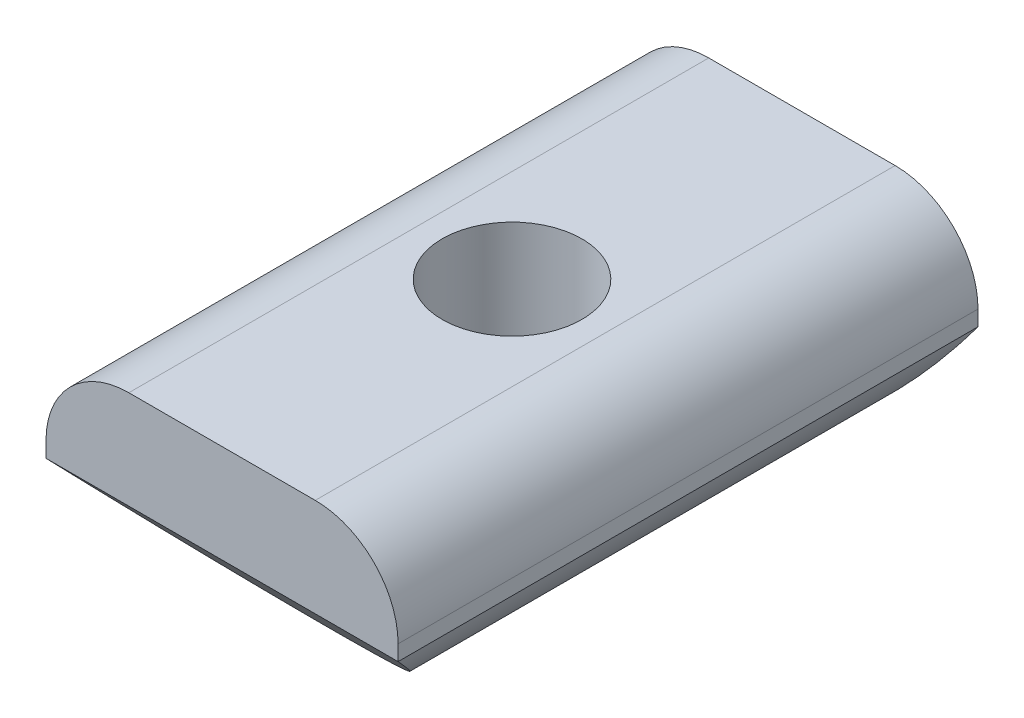
ISO-10303-21;
HEADER;
FILE_DESCRIPTION(('STEP AP214'),'2;1');
FILE_NAME('part.step','',(''),(''),'','','');
FILE_SCHEMA(('AUTOMOTIVE_DESIGN { 1 0 10303 214 1 1 1 1 }'));
ENDSEC;
DATA;
#1=APPLICATION_CONTEXT('core data for automotive mechanical design processes');
#2=APPLICATION_PROTOCOL_DEFINITION('international standard','automotive_design',2000,#1);
#3=PRODUCT_CONTEXT('',#1,'mechanical');
#4=PRODUCT('Part','Part','',(#3));
#5=PRODUCT_RELATED_PRODUCT_CATEGORY('part','',(#4));
#6=PRODUCT_DEFINITION_FORMATION('','',#4);
#7=PRODUCT_DEFINITION_CONTEXT('part definition',#1,'design');
#8=PRODUCT_DEFINITION('design','',#6,#7);
#9=PRODUCT_DEFINITION_SHAPE('','',#8);
#10=(LENGTH_UNIT() NAMED_UNIT(*) SI_UNIT(.MILLI.,.METRE.));
#11=(NAMED_UNIT(*) PLANE_ANGLE_UNIT() SI_UNIT($,.RADIAN.));
#12=(NAMED_UNIT(*) SI_UNIT($,.STERADIAN.) SOLID_ANGLE_UNIT());
#13=UNCERTAINTY_MEASURE_WITH_UNIT(LENGTH_MEASURE(1.E-05),#10,'distance_accuracy_value','');
#14=(GEOMETRIC_REPRESENTATION_CONTEXT(3) GLOBAL_UNCERTAINTY_ASSIGNED_CONTEXT((#13)) GLOBAL_UNIT_ASSIGNED_CONTEXT((#10,
#11,#12)) REPRESENTATION_CONTEXT('',''));
#15=CARTESIAN_POINT('',(0.,0.,0.));
#16=DIRECTION('',(0.,0.,1.));
#17=DIRECTION('',(1.,0.,0.));
#18=AXIS2_PLACEMENT_3D('',#15,#16,#17);
#19=CARTESIAN_POINT('',(-4.49999999999994,-3.49999999999984,13.9999999999999));
#20=DIRECTION('',(0.,0.,-0.999999999999995));
#21=DIRECTION('',(-1.,0.,0.));
#22=AXIS2_PLACEMENT_3D('',#19,#20,#21);
#23=CYLINDRICAL_SURFACE('',#22,4.);
#24=CARTESIAN_POINT('',(-4.49999999999991,-3.49999999999973,-13.9999999999999));
#25=DIRECTION('',(0.,0.,0.999999999999995));
#26=DIRECTION('',(1.,0.,0.));
#27=AXIS2_PLACEMENT_3D('',#24,#25,#26);
#28=CIRCLE('',#27,4.);
#29=CARTESIAN_POINT('',(-4.5,0.500000000000334,-13.9999999999999));
#30=VERTEX_POINT('',#29);
#31=CARTESIAN_POINT('',(-8.49999999999997,-3.49999999999959,-13.9999999999999));
#32=VERTEX_POINT('',#31);
#33=EDGE_CURVE('E126',#30,#32,#28,.T.);
#34=ORIENTED_EDGE('',*,*,#33,.T.);
#35=DIRECTION('',(0.,0.,-0.999999999999995));
#36=VECTOR('',#35,1.);
#37=CARTESIAN_POINT('',(-8.5,-3.49999999999975,13.9999999999999));
#38=LINE('',#37,#36);
#39=CARTESIAN_POINT('',(-8.5,-3.49999999999975,13.9999999999999));
#40=VERTEX_POINT('',#39);
#41=EDGE_CURVE('E11',#40,#32,#38,.T.);
#42=ORIENTED_EDGE('',*,*,#41,.F.);
#43=CARTESIAN_POINT('',(-4.49999999999994,-3.49999999999984,13.9999999999999));
#44=DIRECTION('',(0.,0.,0.999999999999995));
#45=DIRECTION('',(1.,0.,0.));
#46=AXIS2_PLACEMENT_3D('',#43,#44,#45);
#47=CIRCLE('',#46,4.);
#48=CARTESIAN_POINT('',(-4.49999999999993,0.50000000000025,13.9999999999999));
#49=VERTEX_POINT('',#48);
#50=EDGE_CURVE('E96',#49,#40,#47,.T.);
#51=ORIENTED_EDGE('',*,*,#50,.F.);
#52=DIRECTION('',(0.,0.,-0.999999999999995));
#53=VECTOR('',#52,1.);
#54=CARTESIAN_POINT('',(-4.49999999999993,0.50000000000025,13.9999999999999));
#55=LINE('',#54,#53);
#56=EDGE_CURVE('E112',#49,#30,#55,.T.);
#57=ORIENTED_EDGE('',*,*,#56,.T.);
#58=EDGE_LOOP('',(#34,#42,#51,#57));
#59=FACE_BOUND('',#58,.T.);
#60=ADVANCED_FACE('F26',(#59),#23,.T.);
#61=CARTESIAN_POINT('',(-8.50000000000004,-4.24264068711927,13.9999999999999));
#62=DIRECTION('',(1.,0.,0.));
#63=DIRECTION('',(0.,0.999999999999999,0.));
#64=AXIS2_PLACEMENT_3D('',#61,#62,#63);
#65=PLANE('',#64);
#66=DIRECTION('',(0.,-0.999999999999999,0.));
#67=VECTOR('',#66,1.);
#68=CARTESIAN_POINT('',(-8.50000000000001,-4.24264068711919,-13.9999999999999));
#69=LINE('',#68,#67);
#70=CARTESIAN_POINT('',(-8.50000000000001,-4.24264068711919,-13.9999999999999));
#71=VERTEX_POINT('',#70);
#72=EDGE_CURVE('E103',#32,#71,#69,.T.);
#73=ORIENTED_EDGE('',*,*,#72,.T.);
#74=DIRECTION('',(0.,0.,-0.999999999999995));
#75=VECTOR('',#74,1.);
#76=CARTESIAN_POINT('',(-8.50000000000004,-4.24264068711927,13.9999999999999));
#77=LINE('',#76,#75);
#78=CARTESIAN_POINT('',(-8.50000000000004,-4.24264068711927,13.9999999999999));
#79=VERTEX_POINT('',#78);
#80=EDGE_CURVE('E33',#79,#71,#77,.T.);
#81=ORIENTED_EDGE('',*,*,#80,.F.);
#82=DIRECTION('',(0.,-0.999999999999999,0.));
#83=VECTOR('',#82,1.);
#84=CARTESIAN_POINT('',(-8.50000000000004,-4.24264068711927,13.9999999999999));
#85=LINE('',#84,#83);
#86=EDGE_CURVE('E93',#40,#79,#85,.T.);
#87=ORIENTED_EDGE('',*,*,#86,.F.);
#88=ORIENTED_EDGE('',*,*,#41,.T.);
#89=EDGE_LOOP('',(#73,#81,#87,#88));
#90=FACE_BOUND('',#89,.T.);
#91=ADVANCED_FACE('F102',(#90),#65,.F.);
#92=CARTESIAN_POINT('',(0.,0.,13.9999999999999));
#93=DIRECTION('',(0.,0.,-0.999999999999995));
#94=DIRECTION('',(-1.,0.,0.));
#95=AXIS2_PLACEMENT_3D('',#92,#93,#94);
#96=CYLINDRICAL_SURFACE('',#95,9.5);
#97=CARTESIAN_POINT('',(0.,-9.49999999999987,-3.37499999999998));
#98=CARTESIAN_POINT('',(-0.183445904710975,-9.50000253892796,-3.37500355286961));
#99=CARTESIAN_POINT('',(-0.36686648233999,-9.49463884806053,-3.35999561275685));
#100=CARTESIAN_POINT('',(-0.728263584422606,-9.47377410977521,-3.30057419298835));
#101=CARTESIAN_POINT('',(-0.906240255502402,-9.45827333564166,-3.25616150605105));
#102=CARTESIAN_POINT('',(-1.25148711631252,-9.41880833909295,-3.1396740637538));
#103=CARTESIAN_POINT('',(-1.41877600422611,-9.39485940378277,-3.06764925275193));
#104=CARTESIAN_POINT('',(-1.7388933040825,-9.34091185228725,-2.89822239761968));
#105=CARTESIAN_POINT('',(-1.89171828602883,-9.31091180638579,-2.80081435451745));
#106=CARTESIAN_POINT('',(-2.18448525422501,-9.24669020544559,-2.57943697504482));
#107=CARTESIAN_POINT('',(-2.32379157927829,-9.21235786892161,-2.45465937550707));
#108=CARTESIAN_POINT('',(-2.58000085886326,-9.1439168005888,-2.18380154706096));
#109=CARTESIAN_POINT('',(-2.69689793776013,-9.1098081296823,-2.03771574884066));
#110=CARTESIAN_POINT('',(-2.90880828808918,-9.04442204197073,-1.72241665164414));
#111=CARTESIAN_POINT('',(-3.00295872437905,-9.01327749925592,-1.55259318213635));
#112=CARTESIAN_POINT('',(-3.16108405475404,-8.95905058112924,-1.19823880846211));
#113=CARTESIAN_POINT('',(-3.22506960175061,-8.93596536026798,-1.01371312342452));
#114=CARTESIAN_POINT('',(-3.31859960012439,-8.90164644809528,-0.642471483739526));
#115=CARTESIAN_POINT('',(-3.3493471236829,-8.89000027222837,-0.456097971000877));
#116=CARTESIAN_POINT('',(-3.37929029440639,-8.87866423801611,-0.0805010560830065));
#117=CARTESIAN_POINT('',(-3.37849731489831,-8.87897006984372,0.10872129421814));
#118=CARTESIAN_POINT('',(-3.34630871592921,-8.89114498541361,0.474013514737562));
#119=CARTESIAN_POINT('',(-3.31653209864331,-8.90240230951987,0.650250097735145));
#120=CARTESIAN_POINT('',(-3.22988071983286,-8.93420272630661,0.995039910954636));
#121=CARTESIAN_POINT('',(-3.17300229453035,-8.95474707444103,1.16359209897942));
#122=CARTESIAN_POINT('',(-3.03279141541049,-9.0032072901633,1.49171100039146));
#123=CARTESIAN_POINT('',(-2.9490103633458,-9.03124670288113,1.65106697662924));
#124=CARTESIAN_POINT('',(-2.75768430366571,-9.09149138951172,1.95394841739376));
#125=CARTESIAN_POINT('',(-2.65013171476458,-9.12369799107452,2.09746880964989));
#126=CARTESIAN_POINT('',(-2.40672918839065,-9.19100123527,2.37363518819441));
#127=CARTESIAN_POINT('',(-2.26957129495331,-9.22615550612794,2.50511694727477));
#128=CARTESIAN_POINT('',(-1.97473225860226,-9.29372266136284,2.74353881833009));
#129=CARTESIAN_POINT('',(-1.81704857904702,-9.32613520609044,2.85047589247421));
#130=CARTESIAN_POINT('',(-1.48290956962282,-9.38509884430814,3.0378839384626));
#131=CARTESIAN_POINT('',(-1.30624266437047,-9.41157089867901,3.11800428971491));
#132=CARTESIAN_POINT('',(-0.94076743527653,-9.45509138364193,3.24701304259031));
#133=CARTESIAN_POINT('',(-0.751963961711204,-9.47214355299261,3.29591383647814));
#134=CARTESIAN_POINT('',(-0.377401675463292,-9.49426408822737,3.35894314438028));
#135=CARTESIAN_POINT('',(-0.191938730910385,-9.49987316585285,3.37464194821378));
#136=CARTESIAN_POINT('',(0.179032693058821,-9.50012245106516,3.37534571400991));
#137=CARTESIAN_POINT('',(0.364541156506963,-9.49476480077501,3.36035667020746));
#138=CARTESIAN_POINT('',(0.723796782858597,-9.47404000102329,3.30132915803936));
#139=CARTESIAN_POINT('',(0.897729596981435,-9.45901659600721,3.25828766280584));
#140=CARTESIAN_POINT('',(1.23580934889709,-9.42081421828653,3.14565733773132));
#141=CARTESIAN_POINT('',(1.39995501385494,-9.39763418749294,3.0760650635872));
#142=CARTESIAN_POINT('',(1.71895077267429,-9.34462949388564,2.91016512110085));
#143=CARTESIAN_POINT('',(1.87341057830757,-9.31463657255467,2.81316235174891));
#144=CARTESIAN_POINT('',(2.16435121274198,-9.25136676000904,2.59599467442549));
#145=CARTESIAN_POINT('',(2.30082589858493,-9.21808875350102,2.47582188689469));
#146=CARTESIAN_POINT('',(2.5593159725146,-9.14979268564877,2.20836519163386));
#147=CARTESIAN_POINT('',(2.68021281836826,-9.1147739830858,2.05999766228154));
#148=CARTESIAN_POINT('',(2.89557387092436,-9.04866739786607,1.74435547526151));
#149=CARTESIAN_POINT('',(2.99003688631321,-9.01757969240515,1.57707996593029));
#150=CARTESIAN_POINT('',(3.14964922965671,-8.96308365651019,1.22769353480374));
#151=CARTESIAN_POINT('',(3.2147756148853,-8.93968134030036,1.04557113297695));
#152=CARTESIAN_POINT('',(3.31307218293785,-8.90372649200272,0.671898859312014));
#153=CARTESIAN_POINT('',(3.34625943540621,-8.89116816479066,0.480354080798747));
#154=CARTESIAN_POINT('',(3.37829933778126,-8.87904038173259,0.105251785993066));
#155=CARTESIAN_POINT('',(3.37903418764786,-8.87875889645258,-0.0781234968005088));
#156=CARTESIAN_POINT('',(3.3508786348162,-8.88942259189303,-0.442235420702704));
#157=CARTESIAN_POINT('',(3.32199048932197,-8.90036691723259,-0.622972261790271));
#158=CARTESIAN_POINT('',(3.23681335120332,-8.93168555844056,-0.972211422279594));
#159=CARTESIAN_POINT('',(3.18121453628237,-8.95182174560172,-1.14090517749718));
#160=CARTESIAN_POINT('',(3.04477666988052,-8.99914016470203,-1.46668633759447));
#161=CARTESIAN_POINT('',(2.96393157946661,-9.02632408220053,-1.62377095442788));
#162=CARTESIAN_POINT('',(2.77474893324905,-9.0863114274896,-1.9301168043383));
#163=CARTESIAN_POINT('',(2.66527144094031,-9.11932295985549,-2.078632943443));
#164=CARTESIAN_POINT('',(2.42377396686458,-9.18645800754189,-2.35579112828131));
#165=CARTESIAN_POINT('',(2.29174720478988,-9.22058185481827,-2.48442717407197));
#166=CARTESIAN_POINT('',(2.00154190899034,-9.28800292676661,-2.72424253068278));
#167=CARTESIAN_POINT('',(1.842432608626,-9.32118787609675,-2.83433156950864));
#168=CARTESIAN_POINT('',(1.50683180261786,-9.38128329519902,-3.02612301239037));
#169=CARTESIAN_POINT('',(1.33034187786583,-9.40819433487961,-3.10782799512352));
#170=CARTESIAN_POINT('',(0.964814187482106,-9.45267146233774,-3.2399872691922));
#171=CARTESIAN_POINT('',(0.775773842876797,-9.4702356227073,-3.29043511538583));
#172=CARTESIAN_POINT('',(0.391144394238462,-9.49389636056729,-3.35793324482617));
#173=CARTESIAN_POINT('',(0.195557806170315,-9.49999729344064,-3.37499621255435));
#174=CARTESIAN_POINT('',(0.,-9.49999999999987,-3.37499999999998));
#175=B_SPLINE_CURVE_WITH_KNOTS('',3,(#97,#98,#99,#100,#101,#102,#103,#104,#105,#106,#107,#108,
#109,#110,#111,#112,#113,#114,#115,#116,#117,#118,#119,#120,#121,#122,#123,#124,#125,#126,#127,
#128,#129,#130,#131,#132,#133,#134,#135,#136,#137,#138,#139,#140,#141,#142,#143,#144,#145,#146,
#147,#148,#149,#150,#151,#152,#153,#154,#155,#156,#157,#158,#159,#160,#161,#162,#163,#164,#165,
#166,#167,#168,#169,#170,#171,#172,#173,#174),.UNSPECIFIED.,.T.,.F.,(4,2,2,2,2,2,2,2,2,2,2,2,2,
2,2,2,2,2,2,2,2,2,2,2,2,2,2,2,2,2,2,2,2,2,2,2,2,2,4),(0.,0.549617183695842,1.09921955094245,
1.64783246131882,2.19657514645929,2.76446667452133,3.33250689893288,3.91954855359999,
4.50638273539633,5.07118072294454,5.63577504938108,6.17054091013108,6.70537908411884,
7.24964410346513,7.79408295245855,8.37109289425764,8.94817421259,9.5325301270672,
10.1166539433477,10.67246990638,11.228177312643,11.7651391771911,12.3021707228828,
12.8542775300113,13.4065724274611,13.9875409817273,14.5685357147308,15.1499840294503,
15.7311214203628,16.2785064211936,16.8258497156469,17.3597542897822,17.8937866723479,
18.453630542052,19.0136430477351,19.5997035682702,20.1857108315682,20.7718388878926,
21.3577442033933),.UNSPECIFIED.);
#176=CARTESIAN_POINT('',(0.,-9.49999999999987,-3.37499999999998));
#177=VERTEX_POINT('',#176);
#178=EDGE_CURVE('E129',#177,#177,#175,.T.);
#179=ORIENTED_EDGE('',*,*,#178,.T.);
#180=EDGE_LOOP('',(#179));
#181=FACE_BOUND('',#180,.T.);
#182=CARTESIAN_POINT('',(0.,2.4980018054066E-13,18.0349540849572));
#183=DIRECTION('',(0.,0.689148440821934,-0.724620194662482));
#184=DIRECTION('',(0.,-0.724620194662485,-0.689148440821932));
#185=AXIS2_PLACEMENT_3D('',#182,#183,#184);
#186=ELLIPSE('',#185,13.1103163698397,9.5);
#187=CARTESIAN_POINT('',(8.50000000000001,-4.2426406871191,13.9999999999999));
#188=VERTEX_POINT('',#187);
#189=EDGE_CURVE('E78',#188,#79,#186,.T.);
#190=ORIENTED_EDGE('',*,*,#189,.T.);
#191=ORIENTED_EDGE('',*,*,#80,.T.);
#192=CARTESIAN_POINT('',(0.,1.66533453693773E-13,-18.0349540849572));
#193=DIRECTION('',(0.,0.689148440821934,0.724620194662483));
#194=DIRECTION('',(0.,0.724620194662485,-0.689148440821932));
#195=AXIS2_PLACEMENT_3D('',#192,#193,#194);
#196=ELLIPSE('',#195,13.1103163698397,9.5);
#197=CARTESIAN_POINT('',(8.50000000000008,-4.24264068711888,-13.9999999999999));
#198=VERTEX_POINT('',#197);
#199=EDGE_CURVE('E180',#71,#198,#196,.T.);
#200=ORIENTED_EDGE('',*,*,#199,.T.);
#201=DIRECTION('',(0.,0.,-0.999999999999995));
#202=VECTOR('',#201,1.);
#203=CARTESIAN_POINT('',(8.50000000000001,-4.2426406871191,13.9999999999999));
#204=LINE('',#203,#202);
#205=EDGE_CURVE('E83',#188,#198,#204,.T.);
#206=ORIENTED_EDGE('',*,*,#205,.F.);
#207=EDGE_LOOP('',(#190,#191,#200,#206));
#208=FACE_BOUND('',#207,.T.);
#209=ADVANCED_FACE('F80',(#181,#208),#96,.T.);
#210=CARTESIAN_POINT('',(8.50000000000001,-4.2426406871191,13.9999999999999));
#211=DIRECTION('',(-1.,0.,0.));
#212=DIRECTION('',(0.,-0.999999999999999,0.));
#213=AXIS2_PLACEMENT_3D('',#210,#211,#212);
#214=PLANE('',#213);
#215=DIRECTION('',(0.,0.999999999999999,0.));
#216=VECTOR('',#215,1.);
#217=CARTESIAN_POINT('',(8.50000000000008,-4.24264068711888,-13.9999999999999));
#218=LINE('',#217,#216);
#219=CARTESIAN_POINT('',(8.50000000000003,-3.49999999999998,-13.9999999999999));
#220=VERTEX_POINT('',#219);
#221=EDGE_CURVE('E123',#198,#220,#218,.T.);
#222=ORIENTED_EDGE('',*,*,#221,.T.);
#223=DIRECTION('',(0.,0.,-0.999999999999995));
#224=VECTOR('',#223,1.);
#225=CARTESIAN_POINT('',(8.50000000000003,-3.5,13.9999999999999));
#226=LINE('',#225,#224);
#227=CARTESIAN_POINT('',(8.50000000000003,-3.5,13.9999999999999));
#228=VERTEX_POINT('',#227);
#229=EDGE_CURVE('E104',#228,#220,#226,.T.);
#230=ORIENTED_EDGE('',*,*,#229,.F.);
#231=DIRECTION('',(0.,0.999999999999999,0.));
#232=VECTOR('',#231,1.);
#233=CARTESIAN_POINT('',(8.50000000000001,-4.2426406871191,13.9999999999999));
#234=LINE('',#233,#232);
#235=EDGE_CURVE('E99',#188,#228,#234,.T.);
#236=ORIENTED_EDGE('',*,*,#235,.F.);
#237=ORIENTED_EDGE('',*,*,#205,.T.);
#238=EDGE_LOOP('',(#222,#230,#236,#237));
#239=FACE_BOUND('',#238,.T.);
#240=ADVANCED_FACE('F160',(#239),#214,.F.);
#241=CARTESIAN_POINT('',(4.5,-3.50000000000003,13.9999999999999));
#242=DIRECTION('',(0.,0.,-0.999999999999995));
#243=DIRECTION('',(-1.,0.,0.));
#244=AXIS2_PLACEMENT_3D('',#241,#242,#243);
#245=CYLINDRICAL_SURFACE('',#244,4.);
#246=CARTESIAN_POINT('',(4.50000000000004,-3.49999999999975,-13.9999999999999));
#247=DIRECTION('',(0.,0.,0.999999999999995));
#248=DIRECTION('',(-1.,0.,0.));
#249=AXIS2_PLACEMENT_3D('',#246,#247,#248);
#250=CIRCLE('',#249,4.);
#251=CARTESIAN_POINT('',(4.50000000000001,0.500000000000195,-13.9999999999999));
#252=VERTEX_POINT('',#251);
#253=EDGE_CURVE('E121',#220,#252,#250,.T.);
#254=ORIENTED_EDGE('',*,*,#253,.T.);
#255=DIRECTION('',(0.,0.,-0.999999999999995));
#256=VECTOR('',#255,1.);
#257=CARTESIAN_POINT('',(4.50000000000002,0.500000000000195,13.9999999999999));
#258=LINE('',#257,#256);
#259=CARTESIAN_POINT('',(4.50000000000002,0.500000000000195,13.9999999999999));
#260=VERTEX_POINT('',#259);
#261=EDGE_CURVE('E109',#260,#252,#258,.T.);
#262=ORIENTED_EDGE('',*,*,#261,.F.);
#263=CARTESIAN_POINT('',(4.5,-3.50000000000003,13.9999999999999));
#264=DIRECTION('',(0.,0.,0.999999999999995));
#265=DIRECTION('',(-1.,0.,0.));
#266=AXIS2_PLACEMENT_3D('',#263,#264,#265);
#267=CIRCLE('',#266,4.);
#268=EDGE_CURVE('E45',#228,#260,#267,.T.);
#269=ORIENTED_EDGE('',*,*,#268,.F.);
#270=ORIENTED_EDGE('',*,*,#229,.T.);
#271=EDGE_LOOP('',(#254,#262,#269,#270));
#272=FACE_BOUND('',#271,.T.);
#273=ADVANCED_FACE('F157',(#272),#245,.T.);
#274=CARTESIAN_POINT('',(-4.49999999999993,0.50000000000025,13.9999999999999));
#275=DIRECTION('',(0.,-0.999999999999999,0.));
#276=DIRECTION('',(1.,0.,0.));
#277=AXIS2_PLACEMENT_3D('',#274,#275,#276);
#278=PLANE('',#277);
#279=CARTESIAN_POINT('',(0.,0.499999999999945,0.));
#280=DIRECTION('',(0.,0.999999999999999,0.));
#281=DIRECTION('',(-1.,0.,0.));
#282=AXIS2_PLACEMENT_3D('',#279,#280,#281);
#283=CIRCLE('',#282,3.375);
#284=CARTESIAN_POINT('',(-3.37499999999999,0.499999999999943,0.));
#285=VERTEX_POINT('',#284);
#286=EDGE_CURVE('E136',#285,#285,#283,.T.);
#287=ORIENTED_EDGE('',*,*,#286,.F.);
#288=EDGE_LOOP('',(#287));
#289=FACE_BOUND('',#288,.T.);
#290=DIRECTION('',(-1.,0.,0.));
#291=VECTOR('',#290,1.);
#292=CARTESIAN_POINT('',(-4.5,0.500000000000334,-13.9999999999999));
#293=LINE('',#292,#291);
#294=EDGE_CURVE('E119',#252,#30,#293,.T.);
#295=ORIENTED_EDGE('',*,*,#294,.T.);
#296=ORIENTED_EDGE('',*,*,#56,.F.);
#297=DIRECTION('',(-1.,0.,0.));
#298=VECTOR('',#297,1.);
#299=CARTESIAN_POINT('',(-4.49999999999993,0.50000000000025,13.9999999999999));
#300=LINE('',#299,#298);
#301=EDGE_CURVE('E40',#260,#49,#300,.T.);
#302=ORIENTED_EDGE('',*,*,#301,.F.);
#303=ORIENTED_EDGE('',*,*,#261,.T.);
#304=EDGE_LOOP('',(#295,#296,#302,#303));
#305=FACE_BOUND('',#304,.T.);
#306=ADVANCED_FACE('F154',(#289,#305),#278,.F.);
#307=CARTESIAN_POINT('',(-4.49999999999994,-3.49999999999984,13.9999999999999));
#308=DIRECTION('',(0.,0.,0.999999999999995));
#309=DIRECTION('',(1.,0.,0.));
#310=AXIS2_PLACEMENT_3D('',#307,#308,#309);
#311=PLANE('',#310);
#312=DIRECTION('',(1.,0.,0.));
#313=VECTOR('',#312,1.);
#314=CARTESIAN_POINT('',(-8.50000000000004,-4.24264068711927,13.9999999999999));
#315=LINE('',#314,#313);
#316=EDGE_CURVE('E88',#79,#188,#315,.T.);
#317=ORIENTED_EDGE('',*,*,#316,.T.);
#318=ORIENTED_EDGE('',*,*,#235,.T.);
#319=ORIENTED_EDGE('',*,*,#268,.T.);
#320=ORIENTED_EDGE('',*,*,#301,.T.);
#321=ORIENTED_EDGE('',*,*,#50,.T.);
#322=ORIENTED_EDGE('',*,*,#86,.T.);
#323=EDGE_LOOP('',(#317,#318,#319,#320,#321,#322));
#324=FACE_BOUND('',#323,.T.);
#325=ADVANCED_FACE('F94',(#324),#311,.T.);
#326=CARTESIAN_POINT('',(-4.49999999999991,-3.49999999999973,-13.9999999999999));
#327=DIRECTION('',(0.,0.,0.999999999999995));
#328=DIRECTION('',(1.,0.,0.));
#329=AXIS2_PLACEMENT_3D('',#326,#327,#328);
#330=PLANE('',#329);
#331=ORIENTED_EDGE('',*,*,#221,.F.);
#332=DIRECTION('',(1.,0.,0.));
#333=VECTOR('',#332,1.);
#334=CARTESIAN_POINT('',(-8.50000000000001,-4.24264068711919,-13.9999999999999));
#335=LINE('',#334,#333);
#336=EDGE_CURVE('E87',#71,#198,#335,.T.);
#337=ORIENTED_EDGE('',*,*,#336,.F.);
#338=ORIENTED_EDGE('',*,*,#72,.F.);
#339=ORIENTED_EDGE('',*,*,#33,.F.);
#340=ORIENTED_EDGE('',*,*,#294,.F.);
#341=ORIENTED_EDGE('',*,*,#253,.F.);
#342=EDGE_LOOP('',(#331,#337,#338,#339,#340,#341));
#343=FACE_BOUND('',#342,.T.);
#344=ADVANCED_FACE('F146',(#343),#330,.F.);
#345=CARTESIAN_POINT('',(0.,-9.4999999999999,0.));
#346=DIRECTION('',(0.,0.999999999999999,0.));
#347=DIRECTION('',(-1.,0.,0.));
#348=AXIS2_PLACEMENT_3D('',#345,#346,#347);
#349=CYLINDRICAL_SURFACE('',#348,3.375);
#350=ORIENTED_EDGE('',*,*,#286,.T.);
#351=EDGE_LOOP('',(#350));
#352=FACE_BOUND('',#351,.T.);
#353=ORIENTED_EDGE('',*,*,#178,.F.);
#354=EDGE_LOOP('',(#353));
#355=FACE_BOUND('',#354,.T.);
#356=ADVANCED_FACE('F140',(#352,#355),#349,.F.);
#357=CARTESIAN_POINT('',(-8.50000000000001,-4.24264068711919,-13.9999999999999));
#358=DIRECTION('',(0.,0.689148440821934,0.724620194662483));
#359=DIRECTION('',(0.,-0.724620194662485,0.689148440821932));
#360=AXIS2_PLACEMENT_3D('',#357,#358,#359);
#361=PLANE('',#360);
#362=ORIENTED_EDGE('',*,*,#336,.T.);
#363=ORIENTED_EDGE('',*,*,#199,.F.);
#364=EDGE_LOOP('',(#362,#363));
#365=FACE_BOUND('',#364,.T.);
#366=ADVANCED_FACE('F145',(#365),#361,.F.);
#367=CARTESIAN_POINT('',(-8.50000000000004,-4.24264068711927,13.9999999999999));
#368=DIRECTION('',(0.,0.689148440821934,-0.724620194662482));
#369=DIRECTION('',(0.,0.724620194662485,0.689148440821932));
#370=AXIS2_PLACEMENT_3D('',#367,#368,#369);
#371=PLANE('',#370);
#372=ORIENTED_EDGE('',*,*,#189,.F.);
#373=ORIENTED_EDGE('',*,*,#316,.F.);
#374=EDGE_LOOP('',(#372,#373));
#375=FACE_BOUND('',#374,.T.);
#376=ADVANCED_FACE('F91',(#375),#371,.F.);
#377=CLOSED_SHELL('',(#60,#91,#209,#240,#273,#306,#325,#344,#356,#366,#376));
#378=MANIFOLD_SOLID_BREP('B2',#377);
#379=ADVANCED_BREP_SHAPE_REPRESENTATION('',(#18,#378),#14);
#380=SHAPE_DEFINITION_REPRESENTATION(#9,#379);
ENDSEC;
END-ISO-10303-21;
